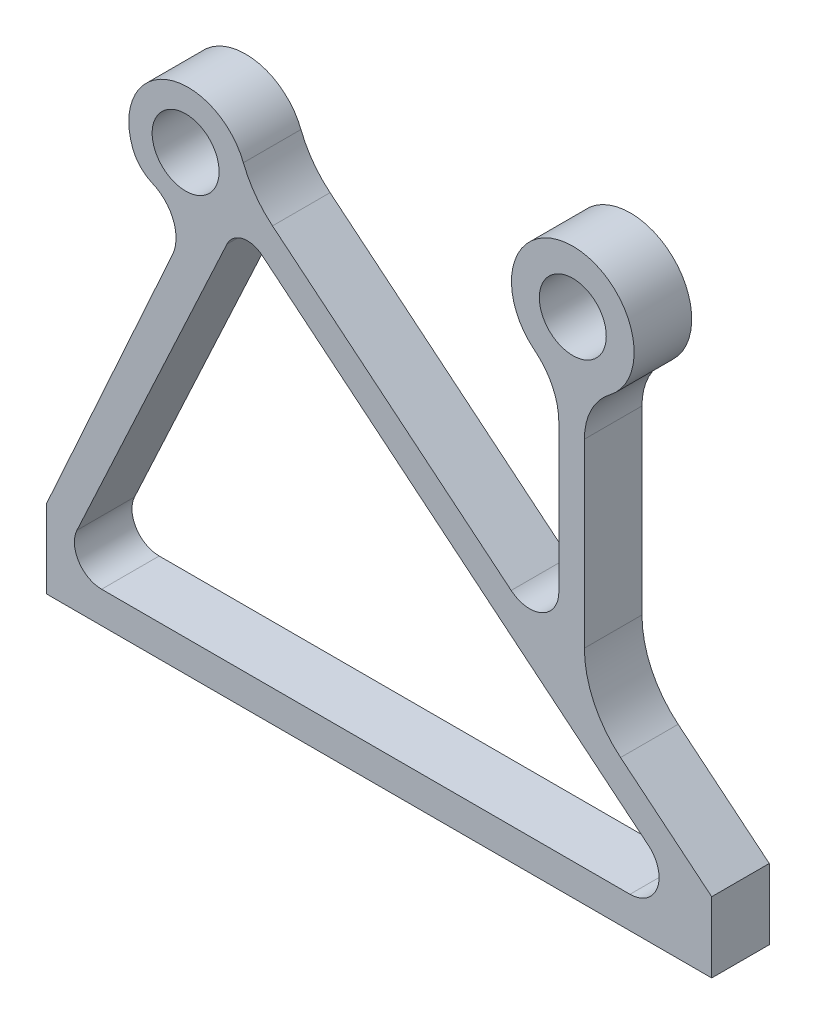
ISO-10303-21;
HEADER;
FILE_DESCRIPTION(('STEP AP214'),'2;1');
FILE_NAME('part.step','',(''),(''),'','','');
FILE_SCHEMA(('AUTOMOTIVE_DESIGN { 1 0 10303 214 1 1 1 1 }'));
ENDSEC;
DATA;
#1=APPLICATION_CONTEXT('core data for automotive mechanical design processes');
#2=APPLICATION_PROTOCOL_DEFINITION('international standard','automotive_design',2000,#1);
#3=PRODUCT_CONTEXT('',#1,'mechanical');
#4=PRODUCT('Part','Part','',(#3));
#5=PRODUCT_RELATED_PRODUCT_CATEGORY('part','',(#4));
#6=PRODUCT_DEFINITION_FORMATION('','',#4);
#7=PRODUCT_DEFINITION_CONTEXT('part definition',#1,'design');
#8=PRODUCT_DEFINITION('design','',#6,#7);
#9=PRODUCT_DEFINITION_SHAPE('','',#8);
#10=(LENGTH_UNIT() NAMED_UNIT(*) SI_UNIT(.MILLI.,.METRE.));
#11=(NAMED_UNIT(*) PLANE_ANGLE_UNIT() SI_UNIT($,.RADIAN.));
#12=(NAMED_UNIT(*) SI_UNIT($,.STERADIAN.) SOLID_ANGLE_UNIT());
#13=UNCERTAINTY_MEASURE_WITH_UNIT(LENGTH_MEASURE(1.E-05),#10,'distance_accuracy_value','');
#14=(GEOMETRIC_REPRESENTATION_CONTEXT(3) GLOBAL_UNCERTAINTY_ASSIGNED_CONTEXT((#13)) GLOBAL_UNIT_ASSIGNED_CONTEXT((#10,
#11,#12)) REPRESENTATION_CONTEXT('',''));
#15=CARTESIAN_POINT('',(0.,0.,0.));
#16=DIRECTION('',(0.,0.,1.));
#17=DIRECTION('',(1.,0.,0.));
#18=AXIS2_PLACEMENT_3D('',#15,#16,#17);
#19=CARTESIAN_POINT('',(62.987702031757,259.131800636067,40.));
#20=DIRECTION('',(0.,0.,1.));
#21=DIRECTION('',(1.,0.,0.));
#22=AXIS2_PLACEMENT_3D('',#19,#20,#21);
#23=PLANE('',#22);
#24=CARTESIAN_POINT('',(96.5,314.,40.));
#25=DIRECTION('',(0.,0.,1.));
#26=DIRECTION('',(1.,0.,0.));
#27=AXIS2_PLACEMENT_3D('',#24,#25,#26);
#28=CIRCLE('',#27,23.25);
#29=CARTESIAN_POINT('',(119.75,314.,40.));
#30=VERTEX_POINT('',#29);
#31=EDGE_CURVE('E256',#30,#30,#28,.T.);
#32=ORIENTED_EDGE('',*,*,#31,.F.);
#33=EDGE_LOOP('',(#32));
#34=FACE_BOUND('',#33,.T.);
#35=DIRECTION('',(1.,0.,0.));
#36=VECTOR('',#35,1.);
#37=CARTESIAN_POINT('',(462.,0.,40.));
#38=LINE('',#37,#36);
#39=CARTESIAN_POINT('',(0.,0.,40.));
#40=VERTEX_POINT('',#39);
#41=CARTESIAN_POINT('',(462.,0.,40.));
#42=VERTEX_POINT('',#41);
#43=EDGE_CURVE('E261',#40,#42,#38,.T.);
#44=ORIENTED_EDGE('',*,*,#43,.T.);
#45=DIRECTION('',(0.,1.,0.));
#46=VECTOR('',#45,1.);
#47=CARTESIAN_POINT('',(462.,48.9095330354654,40.));
#48=LINE('',#47,#46);
#49=CARTESIAN_POINT('',(462.,48.9095330354654,40.));
#50=VERTEX_POINT('',#49);
#51=EDGE_CURVE('E266',#42,#50,#48,.T.);
#52=ORIENTED_EDGE('',*,*,#51,.T.);
#53=DIRECTION('',(-0.772236406434372,0.635335291462175,0.));
#54=VECTOR('',#53,1.);
#55=CARTESIAN_POINT('',(398.68680068517,100.998646686324,40.));
#56=LINE('',#55,#54);
#57=CARTESIAN_POINT('',(398.68680068517,100.998646686324,40.));
#58=VERTEX_POINT('',#57);
#59=EDGE_CURVE('E269',#50,#58,#56,.T.);
#60=ORIENTED_EDGE('',*,*,#59,.T.);
#61=CARTESIAN_POINT('',(442.479835565541,154.228140368379,40.));
#62=DIRECTION('',(0.,0.,-1.));
#63=DIRECTION('',(1.,0.,0.));
#64=AXIS2_PLACEMENT_3D('',#61,#62,#63);
#65=CIRCLE('',#64,68.9290134970853);
#66=CARTESIAN_POINT('',(373.550822068455,154.228140368379,40.));
#67=VERTEX_POINT('',#66);
#68=EDGE_CURVE('E271',#58,#67,#65,.T.);
#69=ORIENTED_EDGE('',*,*,#68,.T.);
#70=DIRECTION('',(0.,1.,0.));
#71=VECTOR('',#70,1.);
#72=CARTESIAN_POINT('',(373.550822068455,279.968471302433,40.));
#73=LINE('',#72,#71);
#74=CARTESIAN_POINT('',(373.550822068455,279.968471302433,40.));
#75=VERTEX_POINT('',#74);
#76=EDGE_CURVE('E273',#67,#75,#73,.T.);
#77=ORIENTED_EDGE('',*,*,#76,.T.);
#78=CARTESIAN_POINT('',(418.16099646357,279.968471302433,40.));
#79=DIRECTION('',(0.,0.,-1.));
#80=DIRECTION('',(1.,0.,0.));
#81=AXIS2_PLACEMENT_3D('',#78,#79,#80);
#82=CIRCLE('',#81,44.6101743951151);
#83=CARTESIAN_POINT('',(391.227480575005,315.530436678984,40.));
#84=VERTEX_POINT('',#83);
#85=EDGE_CURVE('E275',#75,#84,#82,.T.);
#86=ORIENTED_EDGE('',*,*,#85,.T.);
#87=CARTESIAN_POINT('',(365.5,349.5,40.));
#88=DIRECTION('',(0.,0.,1.));
#89=DIRECTION('',(-1.,0.,0.));
#90=AXIS2_PLACEMENT_3D('',#87,#88,#89);
#91=CIRCLE('',#90,42.6126095065508);
#92=CARTESIAN_POINT('',(338.963821806921,316.15834833331,40.));
#93=VERTEX_POINT('',#92);
#94=EDGE_CURVE('E277',#84,#93,#91,.T.);
#95=ORIENTED_EDGE('',*,*,#94,.T.);
#96=CARTESIAN_POINT('',(311.183698724077,281.253729425998,40.));
#97=DIRECTION('',(0.,0.,-1.));
#98=DIRECTION('',(1.,0.,0.));
#99=AXIS2_PLACEMENT_3D('',#96,#97,#98);
#100=CIRCLE('',#99,44.6101743951151);
#101=CARTESIAN_POINT('',(355.793873119192,281.253729425998,40.));
#102=VERTEX_POINT('',#101);
#103=EDGE_CURVE('E279',#93,#102,#100,.T.);
#104=ORIENTED_EDGE('',*,*,#103,.T.);
#105=DIRECTION('',(0.,-1.,0.));
#106=VECTOR('',#105,1.);
#107=CARTESIAN_POINT('',(355.793873119192,179.162183826629,40.));
#108=LINE('',#107,#106);
#109=CARTESIAN_POINT('',(355.793873119192,179.162183826629,40.));
#110=VERTEX_POINT('',#109);
#111=EDGE_CURVE('E281',#102,#110,#108,.T.);
#112=ORIENTED_EDGE('',*,*,#111,.T.);
#113=CARTESIAN_POINT('',(335.547665157137,179.162183826629,40.));
#114=DIRECTION('',(0.,0.,-1.));
#115=DIRECTION('',(1.,0.,0.));
#116=AXIS2_PLACEMENT_3D('',#113,#114,#115);
#117=CIRCLE('',#116,20.2462079620557);
#118=CARTESIAN_POINT('',(322.68453472056,163.527324946088,40.));
#119=VERTEX_POINT('',#118);
#120=EDGE_CURVE('E283',#110,#119,#117,.T.);
#121=ORIENTED_EDGE('',*,*,#120,.T.);
#122=DIRECTION('',(-0.772236406434372,0.635335291462176,0.));
#123=VECTOR('',#122,1.);
#124=CARTESIAN_POINT('',(156.856823863525,299.957304330663,40.));
#125=LINE('',#124,#123);
#126=CARTESIAN_POINT('',(156.856823863525,299.957304330663,40.));
#127=VERTEX_POINT('',#126);
#128=EDGE_CURVE('E285',#119,#127,#125,.T.);
#129=ORIENTED_EDGE('',*,*,#128,.T.);
#130=CARTESIAN_POINT('',(200.290740077461,352.750296983769,40.));
#131=DIRECTION('',(0.,0.,-1.));
#132=DIRECTION('',(1.,0.,0.));
#133=AXIS2_PLACEMENT_3D('',#130,#131,#132);
#134=CIRCLE('',#133,68.3637707484757);
#135=CARTESIAN_POINT('',(136.62620707093,327.841816740878,40.));
#136=VERTEX_POINT('',#135);
#137=EDGE_CURVE('E287',#127,#136,#134,.T.);
#138=ORIENTED_EDGE('',*,*,#137,.T.);
#139=CARTESIAN_POINT('',(98.2397900254738,312.823292840388,40.));
#140=DIRECTION('',(0.,0.,1.));
#141=DIRECTION('',(-1.,0.,0.));
#142=AXIS2_PLACEMENT_3D('',#139,#140,#141);
#143=CIRCLE('',#142,41.2198140914937);
#144=CARTESIAN_POINT('',(59.8080198660525,297.921208551581,40.));
#145=VERTEX_POINT('',#144);
#146=EDGE_CURVE('E289',#136,#145,#143,.T.);
#147=ORIENTED_EDGE('',*,*,#146,.T.);
#148=CARTESIAN_POINT('',(83.2386861688789,307.006550255573,40.));
#149=DIRECTION('',(0.,0.,1.));
#150=DIRECTION('',(-1.,0.,0.));
#151=AXIS2_PLACEMENT_3D('',#148,#149,#150);
#152=CIRCLE('',#151,25.1304507972441);
#153=CARTESIAN_POINT('',(73.4483819895321,283.861583170944,40.));
#154=VERTEX_POINT('',#153);
#155=EDGE_CURVE('E291',#145,#154,#152,.T.);
#156=ORIENTED_EDGE('',*,*,#155,.T.);
#157=CARTESIAN_POINT('',(62.987702031757,259.131800636067,40.));
#158=DIRECTION('',(0.,0.,-1.));
#159=DIRECTION('',(1.,0.,0.));
#160=AXIS2_PLACEMENT_3D('',#157,#158,#159);
#161=CIRCLE('',#160,26.8512191418063);
#162=CARTESIAN_POINT('',(87.453362302129,248.067468892304,40.));
#163=VERTEX_POINT('',#162);
#164=EDGE_CURVE('E293',#154,#163,#161,.T.);
#165=ORIENTED_EDGE('',*,*,#164,.T.);
#166=DIRECTION('',(-0.412060684668741,-0.911156403780563,0.));
#167=VECTOR('',#166,1.);
#168=CARTESIAN_POINT('',(0.,54.6889349567377,40.));
#169=LINE('',#168,#167);
#170=CARTESIAN_POINT('',(0.,54.6889349567377,40.));
#171=VERTEX_POINT('',#170);
#172=EDGE_CURVE('E295',#163,#171,#169,.T.);
#173=ORIENTED_EDGE('',*,*,#172,.T.);
#174=DIRECTION('',(0.,-1.,0.));
#175=VECTOR('',#174,1.);
#176=CARTESIAN_POINT('',(0.,0.,40.));
#177=LINE('',#176,#175);
#178=EDGE_CURVE('E297',#171,#40,#177,.T.);
#179=ORIENTED_EDGE('',*,*,#178,.T.);
#180=EDGE_LOOP('',(#44,#52,#60,#69,#77,#86,#95,#104,#112,#121,#129,#138,#147,#156,#165,#173,#179));
#181=FACE_BOUND('',#180,.T.);
#182=CARTESIAN_POINT('',(365.5,349.5,40.));
#183=DIRECTION('',(0.,0.,1.));
#184=DIRECTION('',(1.,0.,0.));
#185=AXIS2_PLACEMENT_3D('',#182,#183,#184);
#186=CIRCLE('',#185,23.25);
#187=CARTESIAN_POINT('',(388.75,349.5,40.));
#188=VERTEX_POINT('',#187);
#189=EDGE_CURVE('E250',#188,#188,#186,.T.);
#190=ORIENTED_EDGE('',*,*,#189,.F.);
#191=EDGE_LOOP('',(#190));
#192=FACE_BOUND('',#191,.T.);
#193=DIRECTION('',(1.,0.,0.));
#194=VECTOR('',#193,1.);
#195=CARTESIAN_POINT('',(38.1404904417367,21.9856521535899,40.));
#196=LINE('',#195,#194);
#197=CARTESIAN_POINT('',(38.1404904417367,21.9856521535899,40.));
#198=VERTEX_POINT('',#197);
#199=CARTESIAN_POINT('',(405.231641071555,21.9856521535899,40.));
#200=VERTEX_POINT('',#199);
#201=EDGE_CURVE('E207',#198,#200,#196,.T.);
#202=ORIENTED_EDGE('',*,*,#201,.F.);
#203=CARTESIAN_POINT('',(38.1404904417367,40.904956585251,40.));
#204=DIRECTION('',(0.,0.,1.));
#205=DIRECTION('',(1.,0.,0.));
#206=AXIS2_PLACEMENT_3D('',#203,#204,#205);
#207=CIRCLE('',#206,18.9193044316611);
#208=CARTESIAN_POINT('',(20.9832480409857,48.8779806903032,40.));
#209=VERTEX_POINT('',#208);
#210=EDGE_CURVE('E199',#209,#198,#207,.T.);
#211=ORIENTED_EDGE('',*,*,#210,.F.);
#212=DIRECTION('',(-0.42142268675108,-0.906864333344024,0.));
#213=VECTOR('',#212,1.);
#214=CARTESIAN_POINT('',(125.203881252098,273.151561655615,40.));
#215=LINE('',#214,#213);
#216=CARTESIAN_POINT('',(125.203881252098,273.151561655615,40.));
#217=VERTEX_POINT('',#216);
#218=EDGE_CURVE('E228',#217,#209,#215,.T.);
#219=ORIENTED_EDGE('',*,*,#218,.F.);
#220=CARTESIAN_POINT('',(139.534033083633,266.49229536368,40.));
#221=DIRECTION('',(0.,0.,1.));
#222=DIRECTION('',(1.,0.,0.));
#223=AXIS2_PLACEMENT_3D('',#220,#221,#222);
#224=CIRCLE('',#223,15.801869479962);
#225=CARTESIAN_POINT('',(149.573518435332,278.695074265831,40.));
#226=VERTEX_POINT('',#225);
#227=EDGE_CURVE('E226',#226,#217,#224,.T.);
#228=ORIENTED_EDGE('',*,*,#227,.F.);
#229=DIRECTION('',(-0.772236406434372,0.635335291462176,0.));
#230=VECTOR('',#229,1.);
#231=CARTESIAN_POINT('',(418.069916049967,57.7973859236338,40.));
#232=LINE('',#231,#230);
#233=CARTESIAN_POINT('',(418.069916049967,57.7973859236338,40.));
#234=VERTEX_POINT('',#233);
#235=EDGE_CURVE('E222',#234,#226,#232,.T.);
#236=ORIENTED_EDGE('',*,*,#235,.F.);
#237=CARTESIAN_POINT('',(405.231641071555,42.1927383188577,40.));
#238=DIRECTION('',(0.,0.,1.));
#239=DIRECTION('',(1.,0.,0.));
#240=AXIS2_PLACEMENT_3D('',#237,#238,#239);
#241=CIRCLE('',#240,20.2070861652678);
#242=EDGE_CURVE('E220',#200,#234,#241,.T.);
#243=ORIENTED_EDGE('',*,*,#242,.F.);
#244=EDGE_LOOP('',(#202,#211,#219,#228,#236,#243));
#245=FACE_BOUND('',#244,.T.);
#246=ADVANCED_FACE('F44',(#34,#181,#192,#245),#23,.T.);
#247=CARTESIAN_POINT('',(62.987702031757,259.131800636067,0.));
#248=DIRECTION('',(0.,0.,1.));
#249=DIRECTION('',(1.,0.,0.));
#250=AXIS2_PLACEMENT_3D('',#247,#248,#249);
#251=PLANE('',#250);
#252=CARTESIAN_POINT('',(365.5,349.5,0.));
#253=DIRECTION('',(0.,0.,1.));
#254=DIRECTION('',(1.,0.,0.));
#255=AXIS2_PLACEMENT_3D('',#252,#253,#254);
#256=CIRCLE('',#255,23.25);
#257=CARTESIAN_POINT('',(388.75,349.5,0.));
#258=VERTEX_POINT('',#257);
#259=EDGE_CURVE('E215',#258,#258,#256,.T.);
#260=ORIENTED_EDGE('',*,*,#259,.T.);
#261=EDGE_LOOP('',(#260));
#262=FACE_BOUND('',#261,.T.);
#263=CARTESIAN_POINT('',(96.5,314.,0.));
#264=DIRECTION('',(0.,0.,1.));
#265=DIRECTION('',(1.,0.,0.));
#266=AXIS2_PLACEMENT_3D('',#263,#264,#265);
#267=CIRCLE('',#266,23.25);
#268=CARTESIAN_POINT('',(119.75,314.,0.));
#269=VERTEX_POINT('',#268);
#270=EDGE_CURVE('E253',#269,#269,#267,.T.);
#271=ORIENTED_EDGE('',*,*,#270,.T.);
#272=EDGE_LOOP('',(#271));
#273=FACE_BOUND('',#272,.T.);
#274=DIRECTION('',(1.,0.,0.));
#275=VECTOR('',#274,1.);
#276=CARTESIAN_POINT('',(462.,0.,0.));
#277=LINE('',#276,#275);
#278=CARTESIAN_POINT('',(0.,0.,0.));
#279=VERTEX_POINT('',#278);
#280=CARTESIAN_POINT('',(462.,0.,0.));
#281=VERTEX_POINT('',#280);
#282=EDGE_CURVE('E259',#279,#281,#277,.T.);
#283=ORIENTED_EDGE('',*,*,#282,.F.);
#284=DIRECTION('',(0.,-1.,0.));
#285=VECTOR('',#284,1.);
#286=CARTESIAN_POINT('',(0.,0.,0.));
#287=LINE('',#286,#285);
#288=CARTESIAN_POINT('',(0.,54.6889349567377,0.));
#289=VERTEX_POINT('',#288);
#290=EDGE_CURVE('E267',#289,#279,#287,.T.);
#291=ORIENTED_EDGE('',*,*,#290,.F.);
#292=DIRECTION('',(-0.412060684668741,-0.911156403780563,0.));
#293=VECTOR('',#292,1.);
#294=CARTESIAN_POINT('',(0.,54.6889349567377,0.));
#295=LINE('',#294,#293);
#296=CARTESIAN_POINT('',(87.453362302129,248.067468892304,0.));
#297=VERTEX_POINT('',#296);
#298=EDGE_CURVE('E332',#297,#289,#295,.T.);
#299=ORIENTED_EDGE('',*,*,#298,.F.);
#300=CARTESIAN_POINT('',(62.987702031757,259.131800636067,0.));
#301=DIRECTION('',(0.,0.,-1.));
#302=DIRECTION('',(1.,0.,0.));
#303=AXIS2_PLACEMENT_3D('',#300,#301,#302);
#304=CIRCLE('',#303,26.8512191418063);
#305=CARTESIAN_POINT('',(73.4483819895321,283.861583170944,0.));
#306=VERTEX_POINT('',#305);
#307=EDGE_CURVE('E330',#306,#297,#304,.T.);
#308=ORIENTED_EDGE('',*,*,#307,.F.);
#309=CARTESIAN_POINT('',(83.2386861688789,307.006550255573,0.));
#310=DIRECTION('',(0.,0.,1.));
#311=DIRECTION('',(-1.,0.,0.));
#312=AXIS2_PLACEMENT_3D('',#309,#310,#311);
#313=CIRCLE('',#312,25.1304507972441);
#314=CARTESIAN_POINT('',(59.8080198660525,297.921208551581,0.));
#315=VERTEX_POINT('',#314);
#316=EDGE_CURVE('E328',#315,#306,#313,.T.);
#317=ORIENTED_EDGE('',*,*,#316,.F.);
#318=CARTESIAN_POINT('',(98.2397900254738,312.823292840388,0.));
#319=DIRECTION('',(0.,0.,1.));
#320=DIRECTION('',(-1.,0.,0.));
#321=AXIS2_PLACEMENT_3D('',#318,#319,#320);
#322=CIRCLE('',#321,41.2198140914937);
#323=CARTESIAN_POINT('',(136.62620707093,327.841816740878,0.));
#324=VERTEX_POINT('',#323);
#325=EDGE_CURVE('E326',#324,#315,#322,.T.);
#326=ORIENTED_EDGE('',*,*,#325,.F.);
#327=CARTESIAN_POINT('',(200.290740077461,352.750296983769,0.));
#328=DIRECTION('',(0.,0.,-1.));
#329=DIRECTION('',(1.,0.,0.));
#330=AXIS2_PLACEMENT_3D('',#327,#328,#329);
#331=CIRCLE('',#330,68.3637707484757);
#332=CARTESIAN_POINT('',(156.856823863525,299.957304330663,0.));
#333=VERTEX_POINT('',#332);
#334=EDGE_CURVE('E324',#333,#324,#331,.T.);
#335=ORIENTED_EDGE('',*,*,#334,.F.);
#336=DIRECTION('',(-0.772236406434372,0.635335291462176,0.));
#337=VECTOR('',#336,1.);
#338=CARTESIAN_POINT('',(156.856823863525,299.957304330663,0.));
#339=LINE('',#338,#337);
#340=CARTESIAN_POINT('',(322.68453472056,163.527324946088,0.));
#341=VERTEX_POINT('',#340);
#342=EDGE_CURVE('E322',#341,#333,#339,.T.);
#343=ORIENTED_EDGE('',*,*,#342,.F.);
#344=CARTESIAN_POINT('',(335.547665157137,179.162183826629,0.));
#345=DIRECTION('',(0.,0.,-1.));
#346=DIRECTION('',(1.,0.,0.));
#347=AXIS2_PLACEMENT_3D('',#344,#345,#346);
#348=CIRCLE('',#347,20.2462079620557);
#349=CARTESIAN_POINT('',(355.793873119192,179.162183826629,0.));
#350=VERTEX_POINT('',#349);
#351=EDGE_CURVE('E320',#350,#341,#348,.T.);
#352=ORIENTED_EDGE('',*,*,#351,.F.);
#353=DIRECTION('',(0.,-1.,0.));
#354=VECTOR('',#353,1.);
#355=CARTESIAN_POINT('',(355.793873119192,179.162183826629,0.));
#356=LINE('',#355,#354);
#357=CARTESIAN_POINT('',(355.793873119192,281.253729425998,0.));
#358=VERTEX_POINT('',#357);
#359=EDGE_CURVE('E318',#358,#350,#356,.T.);
#360=ORIENTED_EDGE('',*,*,#359,.F.);
#361=CARTESIAN_POINT('',(311.183698724077,281.253729425998,0.));
#362=DIRECTION('',(0.,0.,-1.));
#363=DIRECTION('',(1.,0.,0.));
#364=AXIS2_PLACEMENT_3D('',#361,#362,#363);
#365=CIRCLE('',#364,44.6101743951151);
#366=CARTESIAN_POINT('',(338.963821806921,316.15834833331,0.));
#367=VERTEX_POINT('',#366);
#368=EDGE_CURVE('E316',#367,#358,#365,.T.);
#369=ORIENTED_EDGE('',*,*,#368,.F.);
#370=CARTESIAN_POINT('',(365.5,349.5,0.));
#371=DIRECTION('',(0.,0.,1.));
#372=DIRECTION('',(-1.,0.,0.));
#373=AXIS2_PLACEMENT_3D('',#370,#371,#372);
#374=CIRCLE('',#373,42.6126095065508);
#375=CARTESIAN_POINT('',(391.227480575005,315.530436678984,0.));
#376=VERTEX_POINT('',#375);
#377=EDGE_CURVE('E314',#376,#367,#374,.T.);
#378=ORIENTED_EDGE('',*,*,#377,.F.);
#379=CARTESIAN_POINT('',(418.16099646357,279.968471302433,0.));
#380=DIRECTION('',(0.,0.,-1.));
#381=DIRECTION('',(1.,0.,0.));
#382=AXIS2_PLACEMENT_3D('',#379,#380,#381);
#383=CIRCLE('',#382,44.6101743951151);
#384=CARTESIAN_POINT('',(373.550822068455,279.968471302433,0.));
#385=VERTEX_POINT('',#384);
#386=EDGE_CURVE('E312',#385,#376,#383,.T.);
#387=ORIENTED_EDGE('',*,*,#386,.F.);
#388=DIRECTION('',(0.,1.,0.));
#389=VECTOR('',#388,1.);
#390=CARTESIAN_POINT('',(373.550822068455,279.968471302433,0.));
#391=LINE('',#390,#389);
#392=CARTESIAN_POINT('',(373.550822068455,154.228140368379,0.));
#393=VERTEX_POINT('',#392);
#394=EDGE_CURVE('E310',#393,#385,#391,.T.);
#395=ORIENTED_EDGE('',*,*,#394,.F.);
#396=CARTESIAN_POINT('',(442.479835565541,154.228140368379,0.));
#397=DIRECTION('',(0.,0.,-1.));
#398=DIRECTION('',(1.,0.,0.));
#399=AXIS2_PLACEMENT_3D('',#396,#397,#398);
#400=CIRCLE('',#399,68.9290134970853);
#401=CARTESIAN_POINT('',(398.68680068517,100.998646686324,0.));
#402=VERTEX_POINT('',#401);
#403=EDGE_CURVE('E308',#402,#393,#400,.T.);
#404=ORIENTED_EDGE('',*,*,#403,.F.);
#405=DIRECTION('',(-0.772236406434372,0.635335291462175,0.));
#406=VECTOR('',#405,1.);
#407=CARTESIAN_POINT('',(398.68680068517,100.998646686324,0.));
#408=LINE('',#407,#406);
#409=CARTESIAN_POINT('',(462.,48.9095330354654,0.));
#410=VERTEX_POINT('',#409);
#411=EDGE_CURVE('E306',#410,#402,#408,.T.);
#412=ORIENTED_EDGE('',*,*,#411,.F.);
#413=DIRECTION('',(0.,1.,0.));
#414=VECTOR('',#413,1.);
#415=CARTESIAN_POINT('',(462.,48.9095330354654,0.));
#416=LINE('',#415,#414);
#417=EDGE_CURVE('E304',#281,#410,#416,.T.);
#418=ORIENTED_EDGE('',*,*,#417,.F.);
#419=EDGE_LOOP('',(#283,#291,#299,#308,#317,#326,#335,#343,#352,#360,#369,#378,#387,#395,#404,
#412,#418));
#420=FACE_BOUND('',#419,.T.);
#421=CARTESIAN_POINT('',(38.1404904417367,40.904956585251,0.));
#422=DIRECTION('',(0.,0.,1.));
#423=DIRECTION('',(1.,0.,0.));
#424=AXIS2_PLACEMENT_3D('',#421,#422,#423);
#425=CIRCLE('',#424,18.9193044316611);
#426=CARTESIAN_POINT('',(20.9832480409858,48.8779806903032,0.));
#427=VERTEX_POINT('',#426);
#428=CARTESIAN_POINT('',(38.1404904417367,21.9856521535899,0.));
#429=VERTEX_POINT('',#428);
#430=EDGE_CURVE('E67',#427,#429,#425,.T.);
#431=ORIENTED_EDGE('',*,*,#430,.T.);
#432=DIRECTION('',(1.,0.,0.));
#433=VECTOR('',#432,1.);
#434=CARTESIAN_POINT('',(38.1404904417367,21.9856521535899,0.));
#435=LINE('',#434,#433);
#436=CARTESIAN_POINT('',(405.231641071555,21.9856521535899,0.));
#437=VERTEX_POINT('',#436);
#438=EDGE_CURVE('E214',#429,#437,#435,.T.);
#439=ORIENTED_EDGE('',*,*,#438,.T.);
#440=CARTESIAN_POINT('',(405.231641071555,42.1927383188577,0.));
#441=DIRECTION('',(0.,0.,1.));
#442=DIRECTION('',(1.,0.,0.));
#443=AXIS2_PLACEMENT_3D('',#440,#441,#442);
#444=CIRCLE('',#443,20.2070861652678);
#445=CARTESIAN_POINT('',(418.069916049967,57.7973859236338,0.));
#446=VERTEX_POINT('',#445);
#447=EDGE_CURVE('E232',#437,#446,#444,.T.);
#448=ORIENTED_EDGE('',*,*,#447,.T.);
#449=DIRECTION('',(-0.772236406434372,0.635335291462176,0.));
#450=VECTOR('',#449,1.);
#451=CARTESIAN_POINT('',(418.069916049967,57.7973859236338,0.));
#452=LINE('',#451,#450);
#453=CARTESIAN_POINT('',(149.573518435332,278.695074265831,0.));
#454=VERTEX_POINT('',#453);
#455=EDGE_CURVE('E235',#446,#454,#452,.T.);
#456=ORIENTED_EDGE('',*,*,#455,.T.);
#457=CARTESIAN_POINT('',(139.534033083633,266.49229536368,0.));
#458=DIRECTION('',(0.,0.,1.));
#459=DIRECTION('',(1.,0.,0.));
#460=AXIS2_PLACEMENT_3D('',#457,#458,#459);
#461=CIRCLE('',#460,15.801869479962);
#462=CARTESIAN_POINT('',(125.203881252098,273.151561655615,0.));
#463=VERTEX_POINT('',#462);
#464=EDGE_CURVE('E238',#454,#463,#461,.T.);
#465=ORIENTED_EDGE('',*,*,#464,.T.);
#466=DIRECTION('',(-0.42142268675108,-0.906864333344024,0.));
#467=VECTOR('',#466,1.);
#468=CARTESIAN_POINT('',(125.203881252098,273.151561655615,0.));
#469=LINE('',#468,#467);
#470=EDGE_CURVE('E208',#463,#427,#469,.T.);
#471=ORIENTED_EDGE('',*,*,#470,.T.);
#472=EDGE_LOOP('',(#431,#439,#448,#456,#465,#471));
#473=FACE_BOUND('',#472,.T.);
#474=ADVANCED_FACE('F389',(#262,#273,#420,#473),#251,.F.);
#475=CARTESIAN_POINT('',(462.,0.,40.));
#476=DIRECTION('',(0.,1.,0.));
#477=DIRECTION('',(0.,0.,1.));
#478=AXIS2_PLACEMENT_3D('',#475,#476,#477);
#479=PLANE('',#478);
#480=ORIENTED_EDGE('',*,*,#282,.T.);
#481=DIRECTION('',(0.,0.,-1.));
#482=VECTOR('',#481,1.);
#483=CARTESIAN_POINT('',(462.,0.,40.));
#484=LINE('',#483,#482);
#485=EDGE_CURVE('E12',#42,#281,#484,.T.);
#486=ORIENTED_EDGE('',*,*,#485,.F.);
#487=ORIENTED_EDGE('',*,*,#43,.F.);
#488=DIRECTION('',(0.,0.,-1.));
#489=VECTOR('',#488,1.);
#490=CARTESIAN_POINT('',(0.,0.,40.));
#491=LINE('',#490,#489);
#492=EDGE_CURVE('E301',#40,#279,#491,.T.);
#493=ORIENTED_EDGE('',*,*,#492,.T.);
#494=EDGE_LOOP('',(#480,#486,#487,#493));
#495=FACE_BOUND('',#494,.T.);
#496=ADVANCED_FACE('F46',(#495),#479,.F.);
#497=CARTESIAN_POINT('',(462.,48.9095330354654,40.));
#498=DIRECTION('',(-1.,0.,0.));
#499=DIRECTION('',(0.,-1.,0.));
#500=AXIS2_PLACEMENT_3D('',#497,#498,#499);
#501=PLANE('',#500);
#502=ORIENTED_EDGE('',*,*,#417,.T.);
#503=DIRECTION('',(0.,0.,-1.));
#504=VECTOR('',#503,1.);
#505=CARTESIAN_POINT('',(462.,48.9095330354654,40.));
#506=LINE('',#505,#504);
#507=EDGE_CURVE('E52',#50,#410,#506,.T.);
#508=ORIENTED_EDGE('',*,*,#507,.F.);
#509=ORIENTED_EDGE('',*,*,#51,.F.);
#510=ORIENTED_EDGE('',*,*,#485,.T.);
#511=EDGE_LOOP('',(#502,#508,#509,#510));
#512=FACE_BOUND('',#511,.T.);
#513=ADVANCED_FACE('F407',(#512),#501,.F.);
#514=CARTESIAN_POINT('',(398.68680068517,100.998646686324,40.));
#515=DIRECTION('',(-0.635335291462175,-0.772236406434372,0.));
#516=DIRECTION('',(0.772236406434372,-0.635335291462175,0.));
#517=AXIS2_PLACEMENT_3D('',#514,#515,#516);
#518=PLANE('',#517);
#519=ORIENTED_EDGE('',*,*,#411,.T.);
#520=DIRECTION('',(0.,0.,-1.));
#521=VECTOR('',#520,1.);
#522=CARTESIAN_POINT('',(398.68680068517,100.998646686324,40.));
#523=LINE('',#522,#521);
#524=EDGE_CURVE('E376',#58,#402,#523,.T.);
#525=ORIENTED_EDGE('',*,*,#524,.F.);
#526=ORIENTED_EDGE('',*,*,#59,.F.);
#527=ORIENTED_EDGE('',*,*,#507,.T.);
#528=EDGE_LOOP('',(#519,#525,#526,#527));
#529=FACE_BOUND('',#528,.T.);
#530=ADVANCED_FACE('F383',(#529),#518,.F.);
#531=CARTESIAN_POINT('',(442.479835565541,154.228140368379,40.));
#532=DIRECTION('',(0.,0.,-1.));
#533=DIRECTION('',(-1.,0.,0.));
#534=AXIS2_PLACEMENT_3D('',#531,#532,#533);
#535=CYLINDRICAL_SURFACE('',#534,68.9290134970853);
#536=ORIENTED_EDGE('',*,*,#403,.T.);
#537=DIRECTION('',(0.,0.,-1.));
#538=VECTOR('',#537,1.);
#539=CARTESIAN_POINT('',(373.550822068455,154.228140368379,40.));
#540=LINE('',#539,#538);
#541=EDGE_CURVE('E373',#67,#393,#540,.T.);
#542=ORIENTED_EDGE('',*,*,#541,.F.);
#543=ORIENTED_EDGE('',*,*,#68,.F.);
#544=ORIENTED_EDGE('',*,*,#524,.T.);
#545=EDGE_LOOP('',(#536,#542,#543,#544));
#546=FACE_BOUND('',#545,.T.);
#547=ADVANCED_FACE('F395',(#546),#535,.F.);
#548=CARTESIAN_POINT('',(373.550822068455,279.968471302433,40.));
#549=DIRECTION('',(-1.,0.,0.));
#550=DIRECTION('',(0.,0.,1.));
#551=AXIS2_PLACEMENT_3D('',#548,#549,#550);
#552=PLANE('',#551);
#553=ORIENTED_EDGE('',*,*,#394,.T.);
#554=DIRECTION('',(0.,0.,-1.));
#555=VECTOR('',#554,1.);
#556=CARTESIAN_POINT('',(373.550822068455,279.968471302433,40.));
#557=LINE('',#556,#555);
#558=EDGE_CURVE('E370',#75,#385,#557,.T.);
#559=ORIENTED_EDGE('',*,*,#558,.F.);
#560=ORIENTED_EDGE('',*,*,#76,.F.);
#561=ORIENTED_EDGE('',*,*,#541,.T.);
#562=EDGE_LOOP('',(#553,#559,#560,#561));
#563=FACE_BOUND('',#562,.T.);
#564=ADVANCED_FACE('F399',(#563),#552,.F.);
#565=CARTESIAN_POINT('',(418.16099646357,279.968471302433,40.));
#566=DIRECTION('',(0.,0.,-1.));
#567=DIRECTION('',(-1.,0.,0.));
#568=AXIS2_PLACEMENT_3D('',#565,#566,#567);
#569=CYLINDRICAL_SURFACE('',#568,44.6101743951151);
#570=ORIENTED_EDGE('',*,*,#386,.T.);
#571=DIRECTION('',(0.,0.,-1.));
#572=VECTOR('',#571,1.);
#573=CARTESIAN_POINT('',(391.227480575005,315.530436678984,40.));
#574=LINE('',#573,#572);
#575=EDGE_CURVE('E367',#84,#376,#574,.T.);
#576=ORIENTED_EDGE('',*,*,#575,.F.);
#577=ORIENTED_EDGE('',*,*,#85,.F.);
#578=ORIENTED_EDGE('',*,*,#558,.T.);
#579=EDGE_LOOP('',(#570,#576,#577,#578));
#580=FACE_BOUND('',#579,.T.);
#581=ADVANCED_FACE('F465',(#580),#569,.F.);
#582=CARTESIAN_POINT('',(365.5,349.5,40.));
#583=DIRECTION('',(0.,0.,-1.));
#584=DIRECTION('',(-1.,0.,0.));
#585=AXIS2_PLACEMENT_3D('',#582,#583,#584);
#586=CYLINDRICAL_SURFACE('',#585,42.6126095065508);
#587=ORIENTED_EDGE('',*,*,#377,.T.);
#588=DIRECTION('',(0.,0.,-1.));
#589=VECTOR('',#588,1.);
#590=CARTESIAN_POINT('',(338.963821806921,316.15834833331,40.));
#591=LINE('',#590,#589);
#592=EDGE_CURVE('E364',#93,#367,#591,.T.);
#593=ORIENTED_EDGE('',*,*,#592,.F.);
#594=ORIENTED_EDGE('',*,*,#94,.F.);
#595=ORIENTED_EDGE('',*,*,#575,.T.);
#596=EDGE_LOOP('',(#587,#593,#594,#595));
#597=FACE_BOUND('',#596,.T.);
#598=ADVANCED_FACE('F463',(#597),#586,.T.);
#599=CARTESIAN_POINT('',(311.183698724077,281.253729425998,40.));
#600=DIRECTION('',(0.,0.,-1.));
#601=DIRECTION('',(-1.,0.,0.));
#602=AXIS2_PLACEMENT_3D('',#599,#600,#601);
#603=CYLINDRICAL_SURFACE('',#602,44.6101743951151);
#604=ORIENTED_EDGE('',*,*,#368,.T.);
#605=DIRECTION('',(0.,0.,-1.));
#606=VECTOR('',#605,1.);
#607=CARTESIAN_POINT('',(355.793873119192,281.253729425998,40.));
#608=LINE('',#607,#606);
#609=EDGE_CURVE('E361',#102,#358,#608,.T.);
#610=ORIENTED_EDGE('',*,*,#609,.F.);
#611=ORIENTED_EDGE('',*,*,#103,.F.);
#612=ORIENTED_EDGE('',*,*,#592,.T.);
#613=EDGE_LOOP('',(#604,#610,#611,#612));
#614=FACE_BOUND('',#613,.T.);
#615=ADVANCED_FACE('F458',(#614),#603,.F.);
#616=CARTESIAN_POINT('',(355.793873119192,179.162183826629,40.));
#617=DIRECTION('',(1.,0.,0.));
#618=DIRECTION('',(0.,0.,-1.));
#619=AXIS2_PLACEMENT_3D('',#616,#617,#618);
#620=PLANE('',#619);
#621=ORIENTED_EDGE('',*,*,#359,.T.);
#622=DIRECTION('',(0.,0.,-1.));
#623=VECTOR('',#622,1.);
#624=CARTESIAN_POINT('',(355.793873119192,179.162183826629,40.));
#625=LINE('',#624,#623);
#626=EDGE_CURVE('E358',#110,#350,#625,.T.);
#627=ORIENTED_EDGE('',*,*,#626,.F.);
#628=ORIENTED_EDGE('',*,*,#111,.F.);
#629=ORIENTED_EDGE('',*,*,#609,.T.);
#630=EDGE_LOOP('',(#621,#627,#628,#629));
#631=FACE_BOUND('',#630,.T.);
#632=ADVANCED_FACE('F453',(#631),#620,.F.);
#633=CARTESIAN_POINT('',(335.547665157137,179.162183826629,40.));
#634=DIRECTION('',(0.,0.,-1.));
#635=DIRECTION('',(-1.,0.,0.));
#636=AXIS2_PLACEMENT_3D('',#633,#634,#635);
#637=CYLINDRICAL_SURFACE('',#636,20.2462079620557);
#638=ORIENTED_EDGE('',*,*,#351,.T.);
#639=DIRECTION('',(0.,0.,-1.));
#640=VECTOR('',#639,1.);
#641=CARTESIAN_POINT('',(322.68453472056,163.527324946088,40.));
#642=LINE('',#641,#640);
#643=EDGE_CURVE('E355',#119,#341,#642,.T.);
#644=ORIENTED_EDGE('',*,*,#643,.F.);
#645=ORIENTED_EDGE('',*,*,#120,.F.);
#646=ORIENTED_EDGE('',*,*,#626,.T.);
#647=EDGE_LOOP('',(#638,#644,#645,#646));
#648=FACE_BOUND('',#647,.T.);
#649=ADVANCED_FACE('F449',(#648),#637,.F.);
#650=CARTESIAN_POINT('',(156.856823863525,299.957304330663,40.));
#651=DIRECTION('',(-0.635335291462176,-0.772236406434372,0.));
#652=DIRECTION('',(0.772236406434372,-0.635335291462176,0.));
#653=AXIS2_PLACEMENT_3D('',#650,#651,#652);
#654=PLANE('',#653);
#655=ORIENTED_EDGE('',*,*,#342,.T.);
#656=DIRECTION('',(0.,0.,-1.));
#657=VECTOR('',#656,1.);
#658=CARTESIAN_POINT('',(156.856823863525,299.957304330663,40.));
#659=LINE('',#658,#657);
#660=EDGE_CURVE('E352',#127,#333,#659,.T.);
#661=ORIENTED_EDGE('',*,*,#660,.F.);
#662=ORIENTED_EDGE('',*,*,#128,.F.);
#663=ORIENTED_EDGE('',*,*,#643,.T.);
#664=EDGE_LOOP('',(#655,#661,#662,#663));
#665=FACE_BOUND('',#664,.T.);
#666=ADVANCED_FACE('F444',(#665),#654,.F.);
#667=CARTESIAN_POINT('',(200.290740077461,352.750296983769,40.));
#668=DIRECTION('',(0.,0.,-1.));
#669=DIRECTION('',(-1.,0.,0.));
#670=AXIS2_PLACEMENT_3D('',#667,#668,#669);
#671=CYLINDRICAL_SURFACE('',#670,68.3637707484757);
#672=ORIENTED_EDGE('',*,*,#334,.T.);
#673=DIRECTION('',(0.,0.,-1.));
#674=VECTOR('',#673,1.);
#675=CARTESIAN_POINT('',(136.62620707093,327.841816740878,40.));
#676=LINE('',#675,#674);
#677=EDGE_CURVE('E349',#136,#324,#676,.T.);
#678=ORIENTED_EDGE('',*,*,#677,.F.);
#679=ORIENTED_EDGE('',*,*,#137,.F.);
#680=ORIENTED_EDGE('',*,*,#660,.T.);
#681=EDGE_LOOP('',(#672,#678,#679,#680));
#682=FACE_BOUND('',#681,.T.);
#683=ADVANCED_FACE('F438',(#682),#671,.F.);
#684=CARTESIAN_POINT('',(98.2397900254738,312.823292840388,40.));
#685=DIRECTION('',(0.,0.,-1.));
#686=DIRECTION('',(-1.,0.,0.));
#687=AXIS2_PLACEMENT_3D('',#684,#685,#686);
#688=CYLINDRICAL_SURFACE('',#687,41.2198140914937);
#689=ORIENTED_EDGE('',*,*,#325,.T.);
#690=DIRECTION('',(0.,0.,-1.));
#691=VECTOR('',#690,1.);
#692=CARTESIAN_POINT('',(59.8080198660525,297.921208551581,40.));
#693=LINE('',#692,#691);
#694=EDGE_CURVE('E346',#145,#315,#693,.T.);
#695=ORIENTED_EDGE('',*,*,#694,.F.);
#696=ORIENTED_EDGE('',*,*,#146,.F.);
#697=ORIENTED_EDGE('',*,*,#677,.T.);
#698=EDGE_LOOP('',(#689,#695,#696,#697));
#699=FACE_BOUND('',#698,.T.);
#700=ADVANCED_FACE('F434',(#699),#688,.T.);
#701=CARTESIAN_POINT('',(83.2386861688789,307.006550255573,40.));
#702=DIRECTION('',(0.,0.,-1.));
#703=DIRECTION('',(-1.,0.,0.));
#704=AXIS2_PLACEMENT_3D('',#701,#702,#703);
#705=CYLINDRICAL_SURFACE('',#704,25.1304507972441);
#706=ORIENTED_EDGE('',*,*,#316,.T.);
#707=DIRECTION('',(0.,0.,-1.));
#708=VECTOR('',#707,1.);
#709=CARTESIAN_POINT('',(73.4483819895321,283.861583170944,40.));
#710=LINE('',#709,#708);
#711=EDGE_CURVE('E343',#154,#306,#710,.T.);
#712=ORIENTED_EDGE('',*,*,#711,.F.);
#713=ORIENTED_EDGE('',*,*,#155,.F.);
#714=ORIENTED_EDGE('',*,*,#694,.T.);
#715=EDGE_LOOP('',(#706,#712,#713,#714));
#716=FACE_BOUND('',#715,.T.);
#717=ADVANCED_FACE('F429',(#716),#705,.T.);
#718=CARTESIAN_POINT('',(62.987702031757,259.131800636067,40.));
#719=DIRECTION('',(0.,0.,-1.));
#720=DIRECTION('',(-1.,0.,0.));
#721=AXIS2_PLACEMENT_3D('',#718,#719,#720);
#722=CYLINDRICAL_SURFACE('',#721,26.8512191418063);
#723=ORIENTED_EDGE('',*,*,#307,.T.);
#724=DIRECTION('',(0.,0.,-1.));
#725=VECTOR('',#724,1.);
#726=CARTESIAN_POINT('',(87.453362302129,248.067468892304,40.));
#727=LINE('',#726,#725);
#728=EDGE_CURVE('E340',#163,#297,#727,.T.);
#729=ORIENTED_EDGE('',*,*,#728,.F.);
#730=ORIENTED_EDGE('',*,*,#164,.F.);
#731=ORIENTED_EDGE('',*,*,#711,.T.);
#732=EDGE_LOOP('',(#723,#729,#730,#731));
#733=FACE_BOUND('',#732,.T.);
#734=ADVANCED_FACE('F423',(#733),#722,.F.);
#735=CARTESIAN_POINT('',(0.,54.6889349567377,40.));
#736=DIRECTION('',(0.911156403780563,-0.41206068466874,0.));
#737=DIRECTION('',(0.41206068466874,0.911156403780563,0.));
#738=AXIS2_PLACEMENT_3D('',#735,#736,#737);
#739=PLANE('',#738);
#740=ORIENTED_EDGE('',*,*,#298,.T.);
#741=DIRECTION('',(0.,0.,-1.));
#742=VECTOR('',#741,1.);
#743=CARTESIAN_POINT('',(0.,54.6889349567377,40.));
#744=LINE('',#743,#742);
#745=EDGE_CURVE('E337',#171,#289,#744,.T.);
#746=ORIENTED_EDGE('',*,*,#745,.F.);
#747=ORIENTED_EDGE('',*,*,#172,.F.);
#748=ORIENTED_EDGE('',*,*,#728,.T.);
#749=EDGE_LOOP('',(#740,#746,#747,#748));
#750=FACE_BOUND('',#749,.T.);
#751=ADVANCED_FACE('F419',(#750),#739,.F.);
#752=CARTESIAN_POINT('',(0.,0.,40.));
#753=DIRECTION('',(1.,0.,0.));
#754=DIRECTION('',(0.,0.,-1.));
#755=AXIS2_PLACEMENT_3D('',#752,#753,#754);
#756=PLANE('',#755);
#757=ORIENTED_EDGE('',*,*,#290,.T.);
#758=ORIENTED_EDGE('',*,*,#492,.F.);
#759=ORIENTED_EDGE('',*,*,#178,.F.);
#760=ORIENTED_EDGE('',*,*,#745,.T.);
#761=EDGE_LOOP('',(#757,#758,#759,#760));
#762=FACE_BOUND('',#761,.T.);
#763=ADVANCED_FACE('F414',(#762),#756,.F.);
#764=CARTESIAN_POINT('',(96.5,314.,40.));
#765=DIRECTION('',(0.,0.,-1.));
#766=DIRECTION('',(-1.,0.,0.));
#767=AXIS2_PLACEMENT_3D('',#764,#765,#766);
#768=CYLINDRICAL_SURFACE('',#767,23.25);
#769=ORIENTED_EDGE('',*,*,#31,.T.);
#770=EDGE_LOOP('',(#769));
#771=FACE_BOUND('',#770,.T.);
#772=ORIENTED_EDGE('',*,*,#270,.F.);
#773=EDGE_LOOP('',(#772));
#774=FACE_BOUND('',#773,.T.);
#775=ADVANCED_FACE('F484',(#771,#774),#768,.F.);
#776=CARTESIAN_POINT('',(365.5,349.5,40.));
#777=DIRECTION('',(0.,0.,-1.));
#778=DIRECTION('',(-1.,0.,0.));
#779=AXIS2_PLACEMENT_3D('',#776,#777,#778);
#780=CYLINDRICAL_SURFACE('',#779,23.25);
#781=ORIENTED_EDGE('',*,*,#189,.T.);
#782=EDGE_LOOP('',(#781));
#783=FACE_BOUND('',#782,.T.);
#784=ORIENTED_EDGE('',*,*,#259,.F.);
#785=EDGE_LOOP('',(#784));
#786=FACE_BOUND('',#785,.T.);
#787=ADVANCED_FACE('F553',(#783,#786),#780,.F.);
#788=CARTESIAN_POINT('',(38.1404904417367,40.904956585251,40.));
#789=DIRECTION('',(0.,0.,-1.));
#790=DIRECTION('',(-1.,0.,0.));
#791=AXIS2_PLACEMENT_3D('',#788,#789,#790);
#792=CYLINDRICAL_SURFACE('',#791,18.9193044316611);
#793=ORIENTED_EDGE('',*,*,#430,.F.);
#794=DIRECTION('',(0.,0.,-1.));
#795=VECTOR('',#794,1.);
#796=CARTESIAN_POINT('',(20.9832480409857,48.8779806903032,40.));
#797=LINE('',#796,#795);
#798=EDGE_CURVE('E203',#209,#427,#797,.T.);
#799=ORIENTED_EDGE('',*,*,#798,.F.);
#800=ORIENTED_EDGE('',*,*,#210,.T.);
#801=DIRECTION('',(0.,0.,-1.));
#802=VECTOR('',#801,1.);
#803=CARTESIAN_POINT('',(38.1404904417367,21.9856521535899,40.));
#804=LINE('',#803,#802);
#805=EDGE_CURVE('E202',#198,#429,#804,.T.);
#806=ORIENTED_EDGE('',*,*,#805,.T.);
#807=EDGE_LOOP('',(#793,#799,#800,#806));
#808=FACE_BOUND('',#807,.T.);
#809=ADVANCED_FACE('F201',(#808),#792,.F.);
#810=CARTESIAN_POINT('',(38.1404904417367,21.9856521535899,40.));
#811=DIRECTION('',(0.,1.,0.));
#812=DIRECTION('',(0.,0.,1.));
#813=AXIS2_PLACEMENT_3D('',#810,#811,#812);
#814=PLANE('',#813);
#815=ORIENTED_EDGE('',*,*,#438,.F.);
#816=ORIENTED_EDGE('',*,*,#805,.F.);
#817=ORIENTED_EDGE('',*,*,#201,.T.);
#818=DIRECTION('',(0.,0.,-1.));
#819=VECTOR('',#818,1.);
#820=CARTESIAN_POINT('',(405.231641071555,21.9856521535899,40.));
#821=LINE('',#820,#819);
#822=EDGE_CURVE('E216',#200,#437,#821,.T.);
#823=ORIENTED_EDGE('',*,*,#822,.T.);
#824=EDGE_LOOP('',(#815,#816,#817,#823));
#825=FACE_BOUND('',#824,.T.);
#826=ADVANCED_FACE('F211',(#825),#814,.T.);
#827=CARTESIAN_POINT('',(405.231641071555,42.1927383188577,40.));
#828=DIRECTION('',(0.,0.,-1.));
#829=DIRECTION('',(-1.,0.,0.));
#830=AXIS2_PLACEMENT_3D('',#827,#828,#829);
#831=CYLINDRICAL_SURFACE('',#830,20.2070861652678);
#832=ORIENTED_EDGE('',*,*,#447,.F.);
#833=ORIENTED_EDGE('',*,*,#822,.F.);
#834=ORIENTED_EDGE('',*,*,#242,.T.);
#835=DIRECTION('',(0.,0.,-1.));
#836=VECTOR('',#835,1.);
#837=CARTESIAN_POINT('',(418.069916049967,57.7973859236338,40.));
#838=LINE('',#837,#836);
#839=EDGE_CURVE('E247',#234,#446,#838,.T.);
#840=ORIENTED_EDGE('',*,*,#839,.T.);
#841=EDGE_LOOP('',(#832,#833,#834,#840));
#842=FACE_BOUND('',#841,.T.);
#843=ADVANCED_FACE('F570',(#842),#831,.F.);
#844=CARTESIAN_POINT('',(418.069916049967,57.7973859236338,40.));
#845=DIRECTION('',(-0.635335291462176,-0.772236406434372,0.));
#846=DIRECTION('',(0.772236406434372,-0.635335291462176,0.));
#847=AXIS2_PLACEMENT_3D('',#844,#845,#846);
#848=PLANE('',#847);
#849=ORIENTED_EDGE('',*,*,#455,.F.);
#850=ORIENTED_EDGE('',*,*,#839,.F.);
#851=ORIENTED_EDGE('',*,*,#235,.T.);
#852=DIRECTION('',(0.,0.,-1.));
#853=VECTOR('',#852,1.);
#854=CARTESIAN_POINT('',(149.573518435332,278.695074265831,40.));
#855=LINE('',#854,#853);
#856=EDGE_CURVE('E245',#226,#454,#855,.T.);
#857=ORIENTED_EDGE('',*,*,#856,.T.);
#858=EDGE_LOOP('',(#849,#850,#851,#857));
#859=FACE_BOUND('',#858,.T.);
#860=ADVANCED_FACE('F577',(#859),#848,.T.);
#861=CARTESIAN_POINT('',(139.534033083633,266.49229536368,40.));
#862=DIRECTION('',(0.,0.,-1.));
#863=DIRECTION('',(-1.,0.,0.));
#864=AXIS2_PLACEMENT_3D('',#861,#862,#863);
#865=CYLINDRICAL_SURFACE('',#864,15.801869479962);
#866=ORIENTED_EDGE('',*,*,#464,.F.);
#867=ORIENTED_EDGE('',*,*,#856,.F.);
#868=ORIENTED_EDGE('',*,*,#227,.T.);
#869=DIRECTION('',(0.,0.,-1.));
#870=VECTOR('',#869,1.);
#871=CARTESIAN_POINT('',(125.203881252098,273.151561655615,40.));
#872=LINE('',#871,#870);
#873=EDGE_CURVE('E59',#217,#463,#872,.T.);
#874=ORIENTED_EDGE('',*,*,#873,.T.);
#875=EDGE_LOOP('',(#866,#867,#868,#874));
#876=FACE_BOUND('',#875,.T.);
#877=ADVANCED_FACE('F585',(#876),#865,.F.);
#878=CARTESIAN_POINT('',(125.203881252098,273.151561655615,40.));
#879=DIRECTION('',(0.906864333344024,-0.42142268675108,0.));
#880=DIRECTION('',(0.42142268675108,0.906864333344024,0.));
#881=AXIS2_PLACEMENT_3D('',#878,#879,#880);
#882=PLANE('',#881);
#883=ORIENTED_EDGE('',*,*,#470,.F.);
#884=ORIENTED_EDGE('',*,*,#873,.F.);
#885=ORIENTED_EDGE('',*,*,#218,.T.);
#886=ORIENTED_EDGE('',*,*,#798,.T.);
#887=EDGE_LOOP('',(#883,#884,#885,#886));
#888=FACE_BOUND('',#887,.T.);
#889=ADVANCED_FACE('F593',(#888),#882,.T.);
#890=CLOSED_SHELL('',(#246,#474,#496,#513,#530,#547,#564,#581,#598,#615,#632,#649,#666,#683,
#700,#717,#734,#751,#763,#775,#787,#809,#826,#843,#860,#877,#889));
#891=MANIFOLD_SOLID_BREP('B2',#890);
#892=ADVANCED_BREP_SHAPE_REPRESENTATION('',(#18,#891),#14);
#893=SHAPE_DEFINITION_REPRESENTATION(#9,#892);
ENDSEC;
END-ISO-10303-21;
